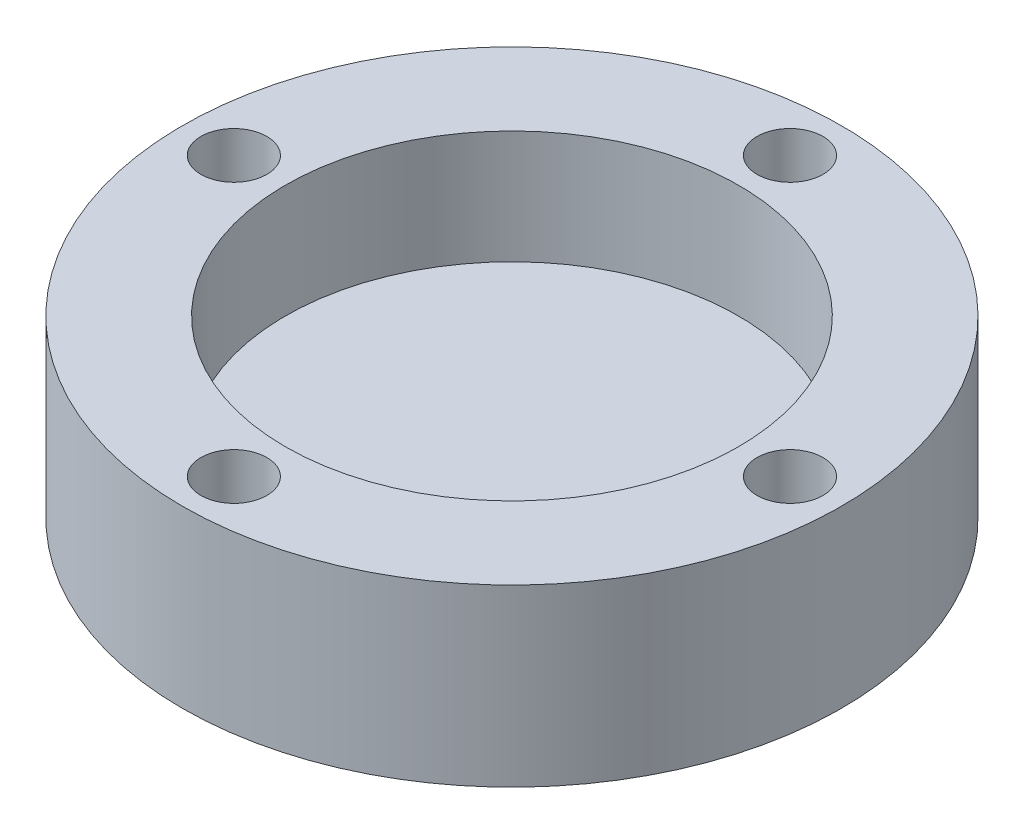
ISO-10303-21;
HEADER;
FILE_DESCRIPTION(('STEP AP214'),'2;1');
FILE_NAME('part.step','',(''),(''),'','','');
FILE_SCHEMA(('AUTOMOTIVE_DESIGN { 1 0 10303 214 1 1 1 1 }'));
ENDSEC;
DATA;
#1=APPLICATION_CONTEXT('core data for automotive mechanical design processes');
#2=APPLICATION_PROTOCOL_DEFINITION('international standard','automotive_design',2000,#1);
#3=PRODUCT_CONTEXT('',#1,'mechanical');
#4=PRODUCT('Part','Part','',(#3));
#5=PRODUCT_RELATED_PRODUCT_CATEGORY('part','',(#4));
#6=PRODUCT_DEFINITION_FORMATION('','',#4);
#7=PRODUCT_DEFINITION_CONTEXT('part definition',#1,'design');
#8=PRODUCT_DEFINITION('design','',#6,#7);
#9=PRODUCT_DEFINITION_SHAPE('','',#8);
#10=(LENGTH_UNIT() NAMED_UNIT(*) SI_UNIT(.MILLI.,.METRE.));
#11=(NAMED_UNIT(*) PLANE_ANGLE_UNIT() SI_UNIT($,.RADIAN.));
#12=(NAMED_UNIT(*) SI_UNIT($,.STERADIAN.) SOLID_ANGLE_UNIT());
#13=UNCERTAINTY_MEASURE_WITH_UNIT(LENGTH_MEASURE(1.E-05),#10,'distance_accuracy_value','');
#14=(GEOMETRIC_REPRESENTATION_CONTEXT(3) GLOBAL_UNCERTAINTY_ASSIGNED_CONTEXT((#13)) GLOBAL_UNIT_ASSIGNED_CONTEXT((#10,
#11,#12)) REPRESENTATION_CONTEXT('',''));
#15=CARTESIAN_POINT('',(0.,0.,0.));
#16=DIRECTION('',(0.,0.,1.));
#17=DIRECTION('',(1.,0.,0.));
#18=AXIS2_PLACEMENT_3D('',#15,#16,#17);
#19=CARTESIAN_POINT('',(11.,8.5,0.));
#20=DIRECTION('',(0.,-1.,0.));
#21=DIRECTION('',(0.,0.,-1.));
#22=AXIS2_PLACEMENT_3D('',#19,#20,#21);
#23=PLANE('',#22);
#24=CARTESIAN_POINT('',(-13.5,8.5,0.));
#25=DIRECTION('',(0.,1.,0.));
#26=DIRECTION('',(0.,0.,-1.));
#27=AXIS2_PLACEMENT_3D('',#24,#25,#26);
#28=CIRCLE('',#27,1.6);
#29=CARTESIAN_POINT('',(-13.5,8.5,-1.6));
#30=VERTEX_POINT('',#29);
#31=EDGE_CURVE('E68',#30,#30,#28,.T.);
#32=ORIENTED_EDGE('',*,*,#31,.F.);
#33=EDGE_LOOP('',(#32));
#34=FACE_BOUND('',#33,.T.);
#35=CARTESIAN_POINT('',(1.41404994223147E-13,8.5,-13.5));
#36=DIRECTION('',(0.,1.,0.));
#37=DIRECTION('',(1.,0.,0.));
#38=AXIS2_PLACEMENT_3D('',#35,#36,#37);
#39=CIRCLE('',#38,1.6);
#40=CARTESIAN_POINT('',(1.60000000000014,8.5,-13.5));
#41=VERTEX_POINT('',#40);
#42=EDGE_CURVE('E62',#41,#41,#39,.T.);
#43=ORIENTED_EDGE('',*,*,#42,.F.);
#44=EDGE_LOOP('',(#43));
#45=FACE_BOUND('',#44,.T.);
#46=CARTESIAN_POINT('',(0.,8.5,13.5));
#47=DIRECTION('',(0.,1.,0.));
#48=DIRECTION('',(-1.,0.,0.));
#49=AXIS2_PLACEMENT_3D('',#46,#47,#48);
#50=CIRCLE('',#49,1.6);
#51=CARTESIAN_POINT('',(-1.60000000000005,8.5,13.5));
#52=VERTEX_POINT('',#51);
#53=EDGE_CURVE('E56',#52,#52,#50,.T.);
#54=ORIENTED_EDGE('',*,*,#53,.F.);
#55=EDGE_LOOP('',(#54));
#56=FACE_BOUND('',#55,.T.);
#57=CARTESIAN_POINT('',(13.5,8.5,0.));
#58=DIRECTION('',(0.,1.,0.));
#59=DIRECTION('',(0.,0.,1.));
#60=AXIS2_PLACEMENT_3D('',#57,#58,#59);
#61=CIRCLE('',#60,1.6);
#62=CARTESIAN_POINT('',(13.5,8.5,1.6));
#63=VERTEX_POINT('',#62);
#64=EDGE_CURVE('E50',#63,#63,#61,.T.);
#65=ORIENTED_EDGE('',*,*,#64,.F.);
#66=EDGE_LOOP('',(#65));
#67=FACE_BOUND('',#66,.T.);
#68=CARTESIAN_POINT('',(0.,8.5,0.));
#69=DIRECTION('',(0.,1.,0.));
#70=DIRECTION('',(0.,0.,1.));
#71=AXIS2_PLACEMENT_3D('',#68,#69,#70);
#72=CIRCLE('',#71,11.);
#73=CARTESIAN_POINT('',(0.,8.5,11.));
#74=VERTEX_POINT('',#73);
#75=EDGE_CURVE('E10',#74,#74,#72,.T.);
#76=ORIENTED_EDGE('',*,*,#75,.F.);
#77=EDGE_LOOP('',(#76));
#78=FACE_BOUND('',#77,.T.);
#79=CARTESIAN_POINT('',(0.,8.5,0.));
#80=DIRECTION('',(0.,1.,0.));
#81=DIRECTION('',(0.,0.,1.));
#82=AXIS2_PLACEMENT_3D('',#79,#80,#81);
#83=CIRCLE('',#82,16.);
#84=CARTESIAN_POINT('',(0.,8.5,16.));
#85=VERTEX_POINT('',#84);
#86=EDGE_CURVE('E44',#85,#85,#83,.T.);
#87=ORIENTED_EDGE('',*,*,#86,.T.);
#88=EDGE_LOOP('',(#87));
#89=FACE_BOUND('',#88,.T.);
#90=ADVANCED_FACE('F30',(#34,#45,#56,#67,#78,#89),#23,.F.);
#91=CARTESIAN_POINT('',(0.,8.4,0.));
#92=DIRECTION('',(0.,1.,0.));
#93=DIRECTION('',(0.,0.,1.));
#94=AXIS2_PLACEMENT_3D('',#91,#92,#93);
#95=CYLINDRICAL_SURFACE('',#94,11.);
#96=CARTESIAN_POINT('',(0.,3.,0.));
#97=DIRECTION('',(0.,1.,0.));
#98=DIRECTION('',(0.,0.,1.));
#99=AXIS2_PLACEMENT_3D('',#96,#97,#98);
#100=CIRCLE('',#99,11.);
#101=CARTESIAN_POINT('',(0.,3.,11.));
#102=VERTEX_POINT('',#101);
#103=EDGE_CURVE('E36',#102,#102,#100,.T.);
#104=ORIENTED_EDGE('',*,*,#103,.F.);
#105=EDGE_LOOP('',(#104));
#106=FACE_BOUND('',#105,.T.);
#107=ORIENTED_EDGE('',*,*,#75,.T.);
#108=EDGE_LOOP('',(#107));
#109=FACE_BOUND('',#108,.T.);
#110=ADVANCED_FACE('F86',(#106,#109),#95,.F.);
#111=CARTESIAN_POINT('',(11.,3.,0.));
#112=DIRECTION('',(0.,-1.,0.));
#113=DIRECTION('',(0.,0.,-1.));
#114=AXIS2_PLACEMENT_3D('',#111,#112,#113);
#115=PLANE('',#114);
#116=ORIENTED_EDGE('',*,*,#103,.T.);
#117=EDGE_LOOP('',(#116));
#118=FACE_BOUND('',#117,.T.);
#119=ADVANCED_FACE('F104',(#118),#115,.F.);
#120=CARTESIAN_POINT('',(0.,0.,0.));
#121=DIRECTION('',(0.,1.,0.));
#122=DIRECTION('',(0.,0.,1.));
#123=AXIS2_PLACEMENT_3D('',#120,#121,#122);
#124=PLANE('',#123);
#125=CARTESIAN_POINT('',(-13.5,0.,0.));
#126=DIRECTION('',(0.,1.,0.));
#127=DIRECTION('',(0.,0.,-1.));
#128=AXIS2_PLACEMENT_3D('',#125,#126,#127);
#129=CIRCLE('',#128,1.6);
#130=CARTESIAN_POINT('',(-13.5,0.,-1.6));
#131=VERTEX_POINT('',#130);
#132=EDGE_CURVE('E59',#131,#131,#129,.T.);
#133=ORIENTED_EDGE('',*,*,#132,.T.);
#134=EDGE_LOOP('',(#133));
#135=FACE_BOUND('',#134,.T.);
#136=CARTESIAN_POINT('',(1.41404994223147E-13,0.,-13.5));
#137=DIRECTION('',(0.,1.,0.));
#138=DIRECTION('',(1.,0.,0.));
#139=AXIS2_PLACEMENT_3D('',#136,#137,#138);
#140=CIRCLE('',#139,1.6);
#141=CARTESIAN_POINT('',(1.60000000000014,0.,-13.5));
#142=VERTEX_POINT('',#141);
#143=EDGE_CURVE('E65',#142,#142,#140,.T.);
#144=ORIENTED_EDGE('',*,*,#143,.T.);
#145=EDGE_LOOP('',(#144));
#146=FACE_BOUND('',#145,.T.);
#147=CARTESIAN_POINT('',(0.,0.,13.5));
#148=DIRECTION('',(0.,1.,0.));
#149=DIRECTION('',(-1.,0.,0.));
#150=AXIS2_PLACEMENT_3D('',#147,#148,#149);
#151=CIRCLE('',#150,1.6);
#152=CARTESIAN_POINT('',(-1.60000000000005,0.,13.5));
#153=VERTEX_POINT('',#152);
#154=EDGE_CURVE('E53',#153,#153,#151,.T.);
#155=ORIENTED_EDGE('',*,*,#154,.T.);
#156=EDGE_LOOP('',(#155));
#157=FACE_BOUND('',#156,.T.);
#158=CARTESIAN_POINT('',(13.5,0.,0.));
#159=DIRECTION('',(0.,1.,0.));
#160=DIRECTION('',(0.,0.,1.));
#161=AXIS2_PLACEMENT_3D('',#158,#159,#160);
#162=CIRCLE('',#161,1.6);
#163=CARTESIAN_POINT('',(13.5,0.,1.6));
#164=VERTEX_POINT('',#163);
#165=EDGE_CURVE('E49',#164,#164,#162,.T.);
#166=ORIENTED_EDGE('',*,*,#165,.T.);
#167=EDGE_LOOP('',(#166));
#168=FACE_BOUND('',#167,.T.);
#169=CARTESIAN_POINT('',(0.,0.,0.));
#170=DIRECTION('',(0.,1.,0.));
#171=DIRECTION('',(0.,0.,1.));
#172=AXIS2_PLACEMENT_3D('',#169,#170,#171);
#173=CIRCLE('',#172,16.);
#174=CARTESIAN_POINT('',(0.,0.,16.));
#175=VERTEX_POINT('',#174);
#176=EDGE_CURVE('E40',#175,#175,#173,.T.);
#177=ORIENTED_EDGE('',*,*,#176,.F.);
#178=EDGE_LOOP('',(#177));
#179=FACE_BOUND('',#178,.T.);
#180=ADVANCED_FACE('F74',(#135,#146,#157,#168,#179),#124,.F.);
#181=CARTESIAN_POINT('',(0.,8.4,0.));
#182=DIRECTION('',(0.,1.,0.));
#183=DIRECTION('',(0.,0.,1.));
#184=AXIS2_PLACEMENT_3D('',#181,#182,#183);
#185=CYLINDRICAL_SURFACE('',#184,16.);
#186=ORIENTED_EDGE('',*,*,#86,.F.);
#187=EDGE_LOOP('',(#186));
#188=FACE_BOUND('',#187,.T.);
#189=ORIENTED_EDGE('',*,*,#176,.T.);
#190=EDGE_LOOP('',(#189));
#191=FACE_BOUND('',#190,.T.);
#192=ADVANCED_FACE('F96',(#188,#191),#185,.T.);
#193=CARTESIAN_POINT('',(13.5,0.,0.));
#194=DIRECTION('',(0.,1.,0.));
#195=DIRECTION('',(0.,0.,1.));
#196=AXIS2_PLACEMENT_3D('',#193,#194,#195);
#197=CYLINDRICAL_SURFACE('',#196,1.6);
#198=ORIENTED_EDGE('',*,*,#165,.F.);
#199=EDGE_LOOP('',(#198));
#200=FACE_BOUND('',#199,.T.);
#201=ORIENTED_EDGE('',*,*,#64,.T.);
#202=EDGE_LOOP('',(#201));
#203=FACE_BOUND('',#202,.T.);
#204=ADVANCED_FACE('F99',(#200,#203),#197,.F.);
#205=CARTESIAN_POINT('',(0.,0.,13.5));
#206=DIRECTION('',(0.,1.,0.));
#207=DIRECTION('',(0.,0.,1.));
#208=AXIS2_PLACEMENT_3D('',#205,#206,#207);
#209=CYLINDRICAL_SURFACE('',#208,1.6);
#210=ORIENTED_EDGE('',*,*,#154,.F.);
#211=EDGE_LOOP('',(#210));
#212=FACE_BOUND('',#211,.T.);
#213=ORIENTED_EDGE('',*,*,#53,.T.);
#214=EDGE_LOOP('',(#213));
#215=FACE_BOUND('',#214,.T.);
#216=ADVANCED_FACE('F136',(#212,#215),#209,.F.);
#217=CARTESIAN_POINT('',(1.41404994223147E-13,0.,-13.5));
#218=DIRECTION('',(0.,1.,0.));
#219=DIRECTION('',(0.,0.,1.));
#220=AXIS2_PLACEMENT_3D('',#217,#218,#219);
#221=CYLINDRICAL_SURFACE('',#220,1.6);
#222=ORIENTED_EDGE('',*,*,#143,.F.);
#223=EDGE_LOOP('',(#222));
#224=FACE_BOUND('',#223,.T.);
#225=ORIENTED_EDGE('',*,*,#42,.T.);
#226=EDGE_LOOP('',(#225));
#227=FACE_BOUND('',#226,.T.);
#228=ADVANCED_FACE('F80',(#224,#227),#221,.F.);
#229=CARTESIAN_POINT('',(-13.5,0.,0.));
#230=DIRECTION('',(0.,1.,0.));
#231=DIRECTION('',(0.,0.,1.));
#232=AXIS2_PLACEMENT_3D('',#229,#230,#231);
#233=CYLINDRICAL_SURFACE('',#232,1.6);
#234=ORIENTED_EDGE('',*,*,#132,.F.);
#235=EDGE_LOOP('',(#234));
#236=FACE_BOUND('',#235,.T.);
#237=ORIENTED_EDGE('',*,*,#31,.T.);
#238=EDGE_LOOP('',(#237));
#239=FACE_BOUND('',#238,.T.);
#240=ADVANCED_FACE('F77',(#236,#239),#233,.F.);
#241=CLOSED_SHELL('',(#90,#110,#119,#180,#192,#204,#216,#228,#240));
#242=MANIFOLD_SOLID_BREP('B2',#241);
#243=ADVANCED_BREP_SHAPE_REPRESENTATION('',(#18,#242),#14);
#244=SHAPE_DEFINITION_REPRESENTATION(#9,#243);
ENDSEC;
END-ISO-10303-21;
